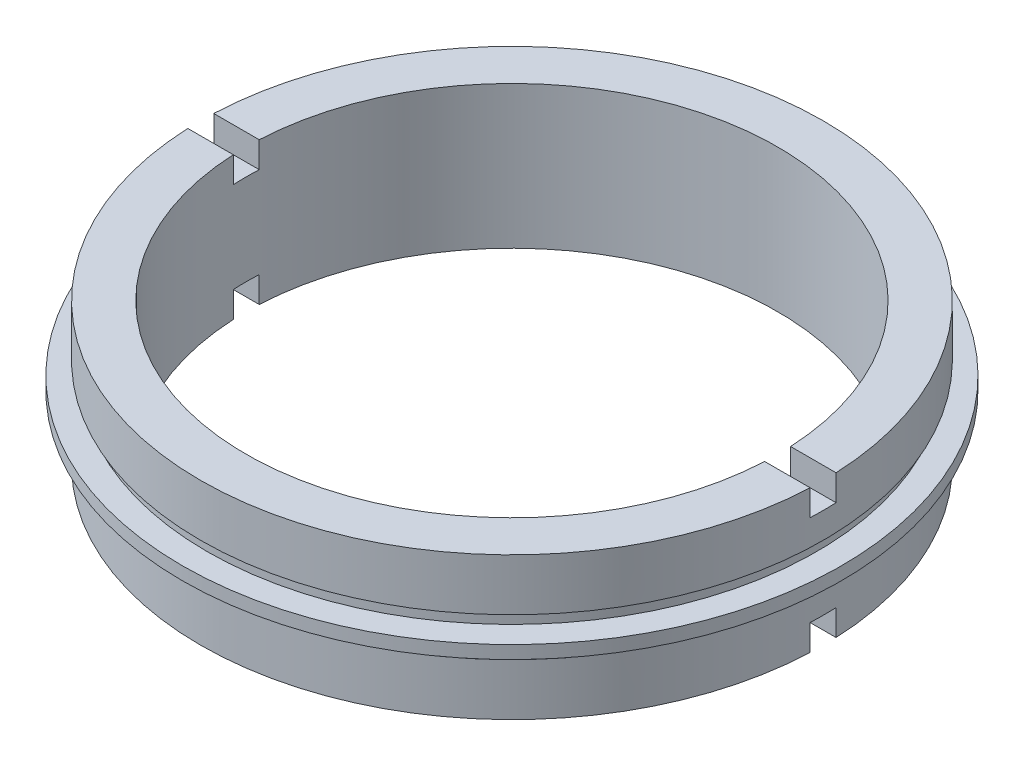
ISO-10303-21;
HEADER;
FILE_DESCRIPTION(('STEP AP214'),'2;1');
FILE_NAME('part.step','',(''),(''),'','','');
FILE_SCHEMA(('AUTOMOTIVE_DESIGN { 1 0 10303 214 1 1 1 1 }'));
ENDSEC;
DATA;
#1=APPLICATION_CONTEXT('core data for automotive mechanical design processes');
#2=APPLICATION_PROTOCOL_DEFINITION('international standard','automotive_design',2000,#1);
#3=PRODUCT_CONTEXT('',#1,'mechanical');
#4=PRODUCT('Part','Part','',(#3));
#5=PRODUCT_RELATED_PRODUCT_CATEGORY('part','',(#4));
#6=PRODUCT_DEFINITION_FORMATION('','',#4);
#7=PRODUCT_DEFINITION_CONTEXT('part definition',#1,'design');
#8=PRODUCT_DEFINITION('design','',#6,#7);
#9=PRODUCT_DEFINITION_SHAPE('','',#8);
#10=(LENGTH_UNIT() NAMED_UNIT(*) SI_UNIT(.MILLI.,.METRE.));
#11=(NAMED_UNIT(*) PLANE_ANGLE_UNIT() SI_UNIT($,.RADIAN.));
#12=(NAMED_UNIT(*) SI_UNIT($,.STERADIAN.) SOLID_ANGLE_UNIT());
#13=UNCERTAINTY_MEASURE_WITH_UNIT(LENGTH_MEASURE(1.E-05),#10,'distance_accuracy_value','');
#14=(GEOMETRIC_REPRESENTATION_CONTEXT(3) GLOBAL_UNCERTAINTY_ASSIGNED_CONTEXT((#13)) GLOBAL_UNIT_ASSIGNED_CONTEXT((#10,
#11,#12)) REPRESENTATION_CONTEXT('',''));
#15=CARTESIAN_POINT('',(0.,0.,0.));
#16=DIRECTION('',(0.,0.,1.));
#17=DIRECTION('',(1.,0.,0.));
#18=AXIS2_PLACEMENT_3D('',#15,#16,#17);
#19=CARTESIAN_POINT('',(-24.,0.,0.));
#20=DIRECTION('',(0.,-1.,0.));
#21=DIRECTION('',(0.,0.,-1.));
#22=AXIS2_PLACEMENT_3D('',#19,#20,#21);
#23=PLANE('',#22);
#24=DIRECTION('',(-1.,0.,0.));
#25=VECTOR('',#24,1.);
#26=CARTESIAN_POINT('',(-24.,0.,1.));
#27=LINE('',#26,#25);
#28=CARTESIAN_POINT('',(23.9791576165636,0.,1.));
#29=VERTEX_POINT('',#28);
#30=CARTESIAN_POINT('',(20.4755952294433,0.,1.));
#31=VERTEX_POINT('',#30);
#32=EDGE_CURVE('E265',#29,#31,#27,.T.);
#33=ORIENTED_EDGE('',*,*,#32,.F.);
#34=CARTESIAN_POINT('',(0.,0.,0.));
#35=DIRECTION('',(0.,1.,0.));
#36=DIRECTION('',(0.,0.,1.));
#37=AXIS2_PLACEMENT_3D('',#34,#35,#36);
#38=CIRCLE('',#37,24.);
#39=CARTESIAN_POINT('',(-23.9791576165636,0.,1.));
#40=VERTEX_POINT('',#39);
#41=EDGE_CURVE('E214',#40,#29,#38,.T.);
#42=ORIENTED_EDGE('',*,*,#41,.F.);
#43=CARTESIAN_POINT('',(-20.4755952294433,0.,1.));
#44=VERTEX_POINT('',#43);
#45=EDGE_CURVE('E264',#44,#40,#27,.T.);
#46=ORIENTED_EDGE('',*,*,#45,.F.);
#47=CARTESIAN_POINT('',(0.,0.,0.));
#48=DIRECTION('',(0.,1.,0.));
#49=DIRECTION('',(0.,0.,1.));
#50=AXIS2_PLACEMENT_3D('',#47,#48,#49);
#51=CIRCLE('',#50,20.5);
#52=EDGE_CURVE('E210',#44,#31,#51,.T.);
#53=ORIENTED_EDGE('',*,*,#52,.T.);
#54=EDGE_LOOP('',(#33,#42,#46,#53));
#55=FACE_BOUND('',#54,.T.);
#56=ADVANCED_FACE('F35',(#55),#23,.T.);
#57=CARTESIAN_POINT('',(-20.5,11.,0.));
#58=DIRECTION('',(0.,1.,0.));
#59=DIRECTION('',(0.,0.,1.));
#60=AXIS2_PLACEMENT_3D('',#57,#58,#59);
#61=PLANE('',#60);
#62=DIRECTION('',(1.,0.,0.));
#63=VECTOR('',#62,1.);
#64=CARTESIAN_POINT('',(-20.5,11.,1.));
#65=LINE('',#64,#63);
#66=CARTESIAN_POINT('',(-23.9791576165636,11.,1.));
#67=VERTEX_POINT('',#66);
#68=CARTESIAN_POINT('',(-20.4755952294433,11.,1.));
#69=VERTEX_POINT('',#68);
#70=EDGE_CURVE('E203',#67,#69,#65,.T.);
#71=ORIENTED_EDGE('',*,*,#70,.F.);
#72=CARTESIAN_POINT('',(0.,11.,0.));
#73=DIRECTION('',(0.,1.,0.));
#74=DIRECTION('',(0.,0.,1.));
#75=AXIS2_PLACEMENT_3D('',#72,#73,#74);
#76=CIRCLE('',#75,24.);
#77=CARTESIAN_POINT('',(23.9791576165636,11.,1.));
#78=VERTEX_POINT('',#77);
#79=EDGE_CURVE('E241',#67,#78,#76,.T.);
#80=ORIENTED_EDGE('',*,*,#79,.T.);
#81=CARTESIAN_POINT('',(20.4755952294433,11.,1.));
#82=VERTEX_POINT('',#81);
#83=EDGE_CURVE('E206',#82,#78,#65,.T.);
#84=ORIENTED_EDGE('',*,*,#83,.F.);
#85=CARTESIAN_POINT('',(0.,11.,0.));
#86=DIRECTION('',(0.,1.,0.));
#87=DIRECTION('',(0.,0.,1.));
#88=AXIS2_PLACEMENT_3D('',#85,#86,#87);
#89=CIRCLE('',#88,20.5);
#90=EDGE_CURVE('E245',#69,#82,#89,.T.);
#91=ORIENTED_EDGE('',*,*,#90,.F.);
#92=EDGE_LOOP('',(#71,#80,#84,#91));
#93=FACE_BOUND('',#92,.T.);
#94=ADVANCED_FACE('F303',(#93),#61,.T.);
#95=CARTESIAN_POINT('',(0.,22.6774994510759,0.));
#96=DIRECTION('',(0.,1.,0.));
#97=DIRECTION('',(0.,0.,1.));
#98=AXIS2_PLACEMENT_3D('',#95,#96,#97);
#99=CYLINDRICAL_SURFACE('',#98,20.5);
#100=DIRECTION('',(0.,1.,0.));
#101=VECTOR('',#100,1.);
#102=CARTESIAN_POINT('',(-20.4755952294433,22.6774994510759,1.));
#103=LINE('',#102,#101);
#104=CARTESIAN_POINT('',(-20.4755952294433,2.,1.));
#105=VERTEX_POINT('',#104);
#106=EDGE_CURVE('E177',#105,#44,#103,.F.);
#107=ORIENTED_EDGE('',*,*,#106,.F.);
#108=CARTESIAN_POINT('',(0.,2.,0.));
#109=DIRECTION('',(0.,1.,0.));
#110=DIRECTION('',(0.,0.,1.));
#111=AXIS2_PLACEMENT_3D('',#108,#109,#110);
#112=CIRCLE('',#111,20.5);
#113=CARTESIAN_POINT('',(-20.4755952294433,2.,-1.));
#114=VERTEX_POINT('',#113);
#115=EDGE_CURVE('E183',#114,#105,#112,.T.);
#116=ORIENTED_EDGE('',*,*,#115,.F.);
#117=DIRECTION('',(0.,1.,0.));
#118=VECTOR('',#117,1.);
#119=CARTESIAN_POINT('',(-20.4755952294433,22.6774994510759,-0.999999999999994));
#120=LINE('',#119,#118);
#121=CARTESIAN_POINT('',(-20.4755952294433,0.,-1.));
#122=VERTEX_POINT('',#121);
#123=EDGE_CURVE('E159',#122,#114,#120,.T.);
#124=ORIENTED_EDGE('',*,*,#123,.F.);
#125=CARTESIAN_POINT('',(20.4755952294433,0.,-1.));
#126=VERTEX_POINT('',#125);
#127=EDGE_CURVE('E213',#126,#122,#51,.T.);
#128=ORIENTED_EDGE('',*,*,#127,.F.);
#129=DIRECTION('',(0.,1.,0.));
#130=VECTOR('',#129,1.);
#131=CARTESIAN_POINT('',(20.4755952294433,22.6774994510759,-0.999999999999994));
#132=LINE('',#131,#130);
#133=CARTESIAN_POINT('',(20.4755952294433,2.,-1.));
#134=VERTEX_POINT('',#133);
#135=EDGE_CURVE('E58',#134,#126,#132,.F.);
#136=ORIENTED_EDGE('',*,*,#135,.F.);
#137=CARTESIAN_POINT('',(20.4755952294433,2.,1.));
#138=VERTEX_POINT('',#137);
#139=EDGE_CURVE('E185',#138,#134,#112,.T.);
#140=ORIENTED_EDGE('',*,*,#139,.F.);
#141=DIRECTION('',(0.,1.,0.));
#142=VECTOR('',#141,1.);
#143=CARTESIAN_POINT('',(20.4755952294433,22.6774994510759,1.));
#144=LINE('',#143,#142);
#145=EDGE_CURVE('E181',#31,#138,#144,.T.);
#146=ORIENTED_EDGE('',*,*,#145,.F.);
#147=ORIENTED_EDGE('',*,*,#52,.F.);
#148=EDGE_LOOP('',(#107,#116,#124,#128,#136,#140,#146,#147));
#149=FACE_BOUND('',#148,.T.);
#150=DIRECTION('',(0.,1.,0.));
#151=VECTOR('',#150,1.);
#152=CARTESIAN_POINT('',(20.4755952294433,22.6774994510759,1.));
#153=LINE('',#152,#151);
#154=CARTESIAN_POINT('',(20.4755952294433,9.,1.));
#155=VERTEX_POINT('',#154);
#156=EDGE_CURVE('E208',#155,#82,#153,.T.);
#157=ORIENTED_EDGE('',*,*,#156,.F.);
#158=CARTESIAN_POINT('',(0.,9.,0.));
#159=DIRECTION('',(0.,-1.,0.));
#160=DIRECTION('',(0.,0.,-1.));
#161=AXIS2_PLACEMENT_3D('',#158,#159,#160);
#162=CIRCLE('',#161,20.5);
#163=CARTESIAN_POINT('',(20.4755952294433,9.,-0.999999999999997));
#164=VERTEX_POINT('',#163);
#165=EDGE_CURVE('E195',#164,#155,#162,.T.);
#166=ORIENTED_EDGE('',*,*,#165,.F.);
#167=DIRECTION('',(0.,1.,0.));
#168=VECTOR('',#167,1.);
#169=CARTESIAN_POINT('',(20.4755952294433,22.6774994510759,-1.));
#170=LINE('',#169,#168);
#171=CARTESIAN_POINT('',(20.4755952294433,11.,-0.999999999999998));
#172=VERTEX_POINT('',#171);
#173=EDGE_CURVE('E198',#172,#164,#170,.F.);
#174=ORIENTED_EDGE('',*,*,#173,.F.);
#175=CARTESIAN_POINT('',(-20.4755952294433,11.,-0.999999999999998));
#176=VERTEX_POINT('',#175);
#177=EDGE_CURVE('E248',#172,#176,#89,.T.);
#178=ORIENTED_EDGE('',*,*,#177,.T.);
#179=DIRECTION('',(0.,1.,0.));
#180=VECTOR('',#179,1.);
#181=CARTESIAN_POINT('',(-20.4755952294433,22.6774994510759,-1.));
#182=LINE('',#181,#180);
#183=CARTESIAN_POINT('',(-20.4755952294433,9.,-0.999999999999997));
#184=VERTEX_POINT('',#183);
#185=EDGE_CURVE('E201',#184,#176,#182,.T.);
#186=ORIENTED_EDGE('',*,*,#185,.F.);
#187=CARTESIAN_POINT('',(-20.4755952294433,9.,1.));
#188=VERTEX_POINT('',#187);
#189=EDGE_CURVE('E193',#188,#184,#162,.T.);
#190=ORIENTED_EDGE('',*,*,#189,.F.);
#191=DIRECTION('',(0.,1.,0.));
#192=VECTOR('',#191,1.);
#193=CARTESIAN_POINT('',(-20.4755952294433,22.6774994510759,1.));
#194=LINE('',#193,#192);
#195=EDGE_CURVE('E205',#69,#188,#194,.F.);
#196=ORIENTED_EDGE('',*,*,#195,.F.);
#197=ORIENTED_EDGE('',*,*,#90,.T.);
#198=EDGE_LOOP('',(#157,#166,#174,#178,#186,#190,#196,#197));
#199=FACE_BOUND('',#198,.T.);
#200=ADVANCED_FACE('F37',(#149,#199),#99,.F.);
#201=DIRECTION('',(-1.,0.,0.));
#202=VECTOR('',#201,1.);
#203=CARTESIAN_POINT('',(-20.5,11.,-0.999999999999998));
#204=LINE('',#203,#202);
#205=CARTESIAN_POINT('',(23.9791576165636,11.,-1.));
#206=VERTEX_POINT('',#205);
#207=EDGE_CURVE('E196',#206,#172,#204,.T.);
#208=ORIENTED_EDGE('',*,*,#207,.F.);
#209=CARTESIAN_POINT('',(-23.9791576165636,11.,-1.));
#210=VERTEX_POINT('',#209);
#211=EDGE_CURVE('E244',#206,#210,#76,.T.);
#212=ORIENTED_EDGE('',*,*,#211,.T.);
#213=EDGE_CURVE('E199',#176,#210,#204,.T.);
#214=ORIENTED_EDGE('',*,*,#213,.F.);
#215=ORIENTED_EDGE('',*,*,#177,.F.);
#216=EDGE_LOOP('',(#208,#212,#214,#215));
#217=FACE_BOUND('',#216,.T.);
#218=ADVANCED_FACE('F309',(#217),#61,.T.);
#219=CARTESIAN_POINT('',(0.,22.6774994510759,0.));
#220=DIRECTION('',(0.,1.,0.));
#221=DIRECTION('',(0.,0.,1.));
#222=AXIS2_PLACEMENT_3D('',#219,#220,#221);
#223=CYLINDRICAL_SURFACE('',#222,24.);
#224=DIRECTION('',(0.,1.,0.));
#225=VECTOR('',#224,1.);
#226=CARTESIAN_POINT('',(-23.9791576165636,22.6774994510759,1.));
#227=LINE('',#226,#225);
#228=CARTESIAN_POINT('',(-23.9791576165636,9.,1.));
#229=VERTEX_POINT('',#228);
#230=EDGE_CURVE('E260',#229,#67,#227,.T.);
#231=ORIENTED_EDGE('',*,*,#230,.F.);
#232=CARTESIAN_POINT('',(0.,9.,0.));
#233=DIRECTION('',(0.,-1.,0.));
#234=DIRECTION('',(0.,0.,-1.));
#235=AXIS2_PLACEMENT_3D('',#232,#233,#234);
#236=CIRCLE('',#235,24.);
#237=CARTESIAN_POINT('',(-23.9791576165636,9.,-0.999999999999997));
#238=VERTEX_POINT('',#237);
#239=EDGE_CURVE('E252',#238,#229,#236,.F.);
#240=ORIENTED_EDGE('',*,*,#239,.F.);
#241=DIRECTION('',(0.,1.,0.));
#242=VECTOR('',#241,1.);
#243=CARTESIAN_POINT('',(-23.9791576165636,22.6774994510759,-1.));
#244=LINE('',#243,#242);
#245=EDGE_CURVE('E257',#210,#238,#244,.F.);
#246=ORIENTED_EDGE('',*,*,#245,.F.);
#247=ORIENTED_EDGE('',*,*,#211,.F.);
#248=DIRECTION('',(0.,1.,0.));
#249=VECTOR('',#248,1.);
#250=CARTESIAN_POINT('',(23.9791576165636,22.6774994510759,-1.));
#251=LINE('',#250,#249);
#252=CARTESIAN_POINT('',(23.9791576165636,9.,-0.999999999999997));
#253=VERTEX_POINT('',#252);
#254=EDGE_CURVE('E251',#253,#206,#251,.T.);
#255=ORIENTED_EDGE('',*,*,#254,.F.);
#256=CARTESIAN_POINT('',(23.9791576165636,9.,1.));
#257=VERTEX_POINT('',#256);
#258=EDGE_CURVE('E249',#257,#253,#236,.F.);
#259=ORIENTED_EDGE('',*,*,#258,.F.);
#260=DIRECTION('',(0.,1.,0.));
#261=VECTOR('',#260,1.);
#262=CARTESIAN_POINT('',(23.9791576165636,22.6774994510759,1.));
#263=LINE('',#262,#261);
#264=EDGE_CURVE('E254',#78,#257,#263,.F.);
#265=ORIENTED_EDGE('',*,*,#264,.F.);
#266=ORIENTED_EDGE('',*,*,#79,.F.);
#267=EDGE_LOOP('',(#231,#240,#246,#247,#255,#259,#265,#266));
#268=FACE_BOUND('',#267,.T.);
#269=CARTESIAN_POINT('',(0.,7.,0.));
#270=DIRECTION('',(0.,1.,0.));
#271=DIRECTION('',(0.,0.,1.));
#272=AXIS2_PLACEMENT_3D('',#269,#270,#271);
#273=CIRCLE('',#272,24.);
#274=CARTESIAN_POINT('',(0.,7.,24.));
#275=VERTEX_POINT('',#274);
#276=EDGE_CURVE('E238',#275,#275,#273,.T.);
#277=ORIENTED_EDGE('',*,*,#276,.T.);
#278=EDGE_LOOP('',(#277));
#279=FACE_BOUND('',#278,.T.);
#280=ADVANCED_FACE('F352',(#268,#279),#223,.T.);
#281=CARTESIAN_POINT('',(-24.,7.,0.));
#282=DIRECTION('',(0.,-1.,0.));
#283=DIRECTION('',(0.,0.,-1.));
#284=AXIS2_PLACEMENT_3D('',#281,#282,#283);
#285=PLANE('',#284);
#286=CARTESIAN_POINT('',(0.,7.,0.));
#287=DIRECTION('',(0.,1.,0.));
#288=DIRECTION('',(0.,0.,1.));
#289=AXIS2_PLACEMENT_3D('',#286,#287,#288);
#290=CIRCLE('',#289,23.5);
#291=CARTESIAN_POINT('',(0.,7.,23.5));
#292=VERTEX_POINT('',#291);
#293=EDGE_CURVE('E235',#292,#292,#290,.T.);
#294=ORIENTED_EDGE('',*,*,#293,.T.);
#295=EDGE_LOOP('',(#294));
#296=FACE_BOUND('',#295,.T.);
#297=ORIENTED_EDGE('',*,*,#276,.F.);
#298=EDGE_LOOP('',(#297));
#299=FACE_BOUND('',#298,.T.);
#300=ADVANCED_FACE('F348',(#296,#299),#285,.T.);
#301=CARTESIAN_POINT('',(0.,22.6774994510759,0.));
#302=DIRECTION('',(0.,1.,0.));
#303=DIRECTION('',(0.,0.,1.));
#304=AXIS2_PLACEMENT_3D('',#301,#302,#303);
#305=CYLINDRICAL_SURFACE('',#304,23.5);
#306=CARTESIAN_POINT('',(0.,6.,0.));
#307=DIRECTION('',(0.,1.,0.));
#308=DIRECTION('',(0.,0.,1.));
#309=AXIS2_PLACEMENT_3D('',#306,#307,#308);
#310=CIRCLE('',#309,23.5);
#311=CARTESIAN_POINT('',(0.,6.,23.5));
#312=VERTEX_POINT('',#311);
#313=EDGE_CURVE('E232',#312,#312,#310,.T.);
#314=ORIENTED_EDGE('',*,*,#313,.T.);
#315=EDGE_LOOP('',(#314));
#316=FACE_BOUND('',#315,.T.);
#317=ORIENTED_EDGE('',*,*,#293,.F.);
#318=EDGE_LOOP('',(#317));
#319=FACE_BOUND('',#318,.T.);
#320=ADVANCED_FACE('F344',(#316,#319),#305,.T.);
#321=CARTESIAN_POINT('',(-23.5,6.,0.));
#322=DIRECTION('',(0.,1.,0.));
#323=DIRECTION('',(0.,0.,1.));
#324=AXIS2_PLACEMENT_3D('',#321,#322,#323);
#325=PLANE('',#324);
#326=CARTESIAN_POINT('',(0.,6.,0.));
#327=DIRECTION('',(0.,1.,0.));
#328=DIRECTION('',(0.,0.,1.));
#329=AXIS2_PLACEMENT_3D('',#326,#327,#328);
#330=CIRCLE('',#329,25.4);
#331=CARTESIAN_POINT('',(0.,6.,25.4));
#332=VERTEX_POINT('',#331);
#333=EDGE_CURVE('E229',#332,#332,#330,.T.);
#334=ORIENTED_EDGE('',*,*,#333,.T.);
#335=EDGE_LOOP('',(#334));
#336=FACE_BOUND('',#335,.T.);
#337=ORIENTED_EDGE('',*,*,#313,.F.);
#338=EDGE_LOOP('',(#337));
#339=FACE_BOUND('',#338,.T.);
#340=ADVANCED_FACE('F340',(#336,#339),#325,.T.);
#341=CARTESIAN_POINT('',(0.,22.6774994510759,0.));
#342=DIRECTION('',(0.,1.,0.));
#343=DIRECTION('',(0.,0.,1.));
#344=AXIS2_PLACEMENT_3D('',#341,#342,#343);
#345=CYLINDRICAL_SURFACE('',#344,25.4);
#346=CARTESIAN_POINT('',(0.,5.,0.));
#347=DIRECTION('',(0.,1.,0.));
#348=DIRECTION('',(0.,0.,1.));
#349=AXIS2_PLACEMENT_3D('',#346,#347,#348);
#350=CIRCLE('',#349,25.4);
#351=CARTESIAN_POINT('',(0.,5.,25.4));
#352=VERTEX_POINT('',#351);
#353=EDGE_CURVE('E226',#352,#352,#350,.T.);
#354=ORIENTED_EDGE('',*,*,#353,.T.);
#355=EDGE_LOOP('',(#354));
#356=FACE_BOUND('',#355,.T.);
#357=ORIENTED_EDGE('',*,*,#333,.F.);
#358=EDGE_LOOP('',(#357));
#359=FACE_BOUND('',#358,.T.);
#360=ADVANCED_FACE('F336',(#356,#359),#345,.T.);
#361=CARTESIAN_POINT('',(-25.4,5.,0.));
#362=DIRECTION('',(0.,-1.,0.));
#363=DIRECTION('',(0.,0.,-1.));
#364=AXIS2_PLACEMENT_3D('',#361,#362,#363);
#365=PLANE('',#364);
#366=CARTESIAN_POINT('',(0.,5.,0.));
#367=DIRECTION('',(0.,1.,0.));
#368=DIRECTION('',(0.,0.,1.));
#369=AXIS2_PLACEMENT_3D('',#366,#367,#368);
#370=CIRCLE('',#369,23.5);
#371=CARTESIAN_POINT('',(0.,5.,23.5));
#372=VERTEX_POINT('',#371);
#373=EDGE_CURVE('E223',#372,#372,#370,.T.);
#374=ORIENTED_EDGE('',*,*,#373,.T.);
#375=EDGE_LOOP('',(#374));
#376=FACE_BOUND('',#375,.T.);
#377=ORIENTED_EDGE('',*,*,#353,.F.);
#378=EDGE_LOOP('',(#377));
#379=FACE_BOUND('',#378,.T.);
#380=ADVANCED_FACE('F332',(#376,#379),#365,.T.);
#381=CARTESIAN_POINT('',(0.,22.6774994510759,0.));
#382=DIRECTION('',(0.,1.,0.));
#383=DIRECTION('',(0.,0.,1.));
#384=AXIS2_PLACEMENT_3D('',#381,#382,#383);
#385=CYLINDRICAL_SURFACE('',#384,23.5);
#386=CARTESIAN_POINT('',(0.,4.,0.));
#387=DIRECTION('',(0.,1.,0.));
#388=DIRECTION('',(0.,0.,1.));
#389=AXIS2_PLACEMENT_3D('',#386,#387,#388);
#390=CIRCLE('',#389,23.5);
#391=CARTESIAN_POINT('',(0.,4.,23.5));
#392=VERTEX_POINT('',#391);
#393=EDGE_CURVE('E220',#392,#392,#390,.T.);
#394=ORIENTED_EDGE('',*,*,#393,.T.);
#395=EDGE_LOOP('',(#394));
#396=FACE_BOUND('',#395,.T.);
#397=ORIENTED_EDGE('',*,*,#373,.F.);
#398=EDGE_LOOP('',(#397));
#399=FACE_BOUND('',#398,.T.);
#400=ADVANCED_FACE('F326',(#396,#399),#385,.T.);
#401=CARTESIAN_POINT('',(-23.5,4.,0.));
#402=DIRECTION('',(0.,1.,0.));
#403=DIRECTION('',(0.,0.,1.));
#404=AXIS2_PLACEMENT_3D('',#401,#402,#403);
#405=PLANE('',#404);
#406=CARTESIAN_POINT('',(0.,4.,0.));
#407=DIRECTION('',(0.,1.,0.));
#408=DIRECTION('',(0.,0.,1.));
#409=AXIS2_PLACEMENT_3D('',#406,#407,#408);
#410=CIRCLE('',#409,24.);
#411=CARTESIAN_POINT('',(0.,4.,24.));
#412=VERTEX_POINT('',#411);
#413=EDGE_CURVE('E217',#412,#412,#410,.T.);
#414=ORIENTED_EDGE('',*,*,#413,.T.);
#415=EDGE_LOOP('',(#414));
#416=FACE_BOUND('',#415,.T.);
#417=ORIENTED_EDGE('',*,*,#393,.F.);
#418=EDGE_LOOP('',(#417));
#419=FACE_BOUND('',#418,.T.);
#420=ADVANCED_FACE('F322',(#416,#419),#405,.T.);
#421=CARTESIAN_POINT('',(0.,22.6774994510759,0.));
#422=DIRECTION('',(0.,1.,0.));
#423=DIRECTION('',(0.,0.,1.));
#424=AXIS2_PLACEMENT_3D('',#421,#422,#423);
#425=CYLINDRICAL_SURFACE('',#424,24.);
#426=DIRECTION('',(0.,1.,0.));
#427=VECTOR('',#426,1.);
#428=CARTESIAN_POINT('',(-23.9791576165636,22.6774994510759,1.));
#429=LINE('',#428,#427);
#430=CARTESIAN_POINT('',(-23.9791576165636,2.,1.));
#431=VERTEX_POINT('',#430);
#432=EDGE_CURVE('E170',#40,#431,#429,.T.);
#433=ORIENTED_EDGE('',*,*,#432,.F.);
#434=ORIENTED_EDGE('',*,*,#41,.T.);
#435=DIRECTION('',(0.,1.,0.));
#436=VECTOR('',#435,1.);
#437=CARTESIAN_POINT('',(23.9791576165636,22.6774994510759,1.));
#438=LINE('',#437,#436);
#439=CARTESIAN_POINT('',(23.9791576165636,2.,1.));
#440=VERTEX_POINT('',#439);
#441=EDGE_CURVE('E179',#440,#29,#438,.F.);
#442=ORIENTED_EDGE('',*,*,#441,.F.);
#443=CARTESIAN_POINT('',(0.,2.,0.));
#444=DIRECTION('',(0.,1.,0.));
#445=DIRECTION('',(0.,0.,1.));
#446=AXIS2_PLACEMENT_3D('',#443,#444,#445);
#447=CIRCLE('',#446,24.);
#448=CARTESIAN_POINT('',(23.9791576165636,2.,-1.));
#449=VERTEX_POINT('',#448);
#450=EDGE_CURVE('E39',#449,#440,#447,.F.);
#451=ORIENTED_EDGE('',*,*,#450,.F.);
#452=DIRECTION('',(0.,1.,0.));
#453=VECTOR('',#452,1.);
#454=CARTESIAN_POINT('',(23.9791576165636,22.6774994510759,-0.999999999999994));
#455=LINE('',#454,#453);
#456=CARTESIAN_POINT('',(23.9791576165636,0.,-1.));
#457=VERTEX_POINT('',#456);
#458=EDGE_CURVE('E172',#457,#449,#455,.T.);
#459=ORIENTED_EDGE('',*,*,#458,.F.);
#460=CARTESIAN_POINT('',(-23.9791576165636,0.,-1.));
#461=VERTEX_POINT('',#460);
#462=EDGE_CURVE('E168',#457,#461,#38,.T.);
#463=ORIENTED_EDGE('',*,*,#462,.T.);
#464=DIRECTION('',(0.,1.,0.));
#465=VECTOR('',#464,1.);
#466=CARTESIAN_POINT('',(-23.9791576165636,22.6774994510759,-0.999999999999994));
#467=LINE('',#466,#465);
#468=CARTESIAN_POINT('',(-23.9791576165636,2.,-1.));
#469=VERTEX_POINT('',#468);
#470=EDGE_CURVE('E50',#469,#461,#467,.F.);
#471=ORIENTED_EDGE('',*,*,#470,.F.);
#472=EDGE_CURVE('E11',#431,#469,#447,.F.);
#473=ORIENTED_EDGE('',*,*,#472,.F.);
#474=EDGE_LOOP('',(#433,#434,#442,#451,#459,#463,#471,#473));
#475=FACE_BOUND('',#474,.T.);
#476=ORIENTED_EDGE('',*,*,#413,.F.);
#477=EDGE_LOOP('',(#476));
#478=FACE_BOUND('',#477,.T.);
#479=ADVANCED_FACE('F164',(#475,#478),#425,.T.);
#480=DIRECTION('',(1.,0.,0.));
#481=VECTOR('',#480,1.);
#482=CARTESIAN_POINT('',(-24.,0.,-1.));
#483=LINE('',#482,#481);
#484=EDGE_CURVE('E263',#461,#122,#483,.T.);
#485=ORIENTED_EDGE('',*,*,#484,.F.);
#486=ORIENTED_EDGE('',*,*,#462,.F.);
#487=EDGE_CURVE('E262',#126,#457,#483,.T.);
#488=ORIENTED_EDGE('',*,*,#487,.F.);
#489=ORIENTED_EDGE('',*,*,#127,.T.);
#490=EDGE_LOOP('',(#485,#486,#488,#489));
#491=FACE_BOUND('',#490,.T.);
#492=ADVANCED_FACE('F274',(#491),#23,.T.);
#493=CARTESIAN_POINT('',(-39.5,9.,1.));
#494=DIRECTION('',(0.,-1.,0.));
#495=DIRECTION('',(0.,0.,-1.));
#496=AXIS2_PLACEMENT_3D('',#493,#494,#495);
#497=PLANE('',#496);
#498=ORIENTED_EDGE('',*,*,#165,.T.);
#499=DIRECTION('',(1.,0.,0.));
#500=VECTOR('',#499,1.);
#501=CARTESIAN_POINT('',(-39.5,9.,1.));
#502=LINE('',#501,#500);
#503=EDGE_CURVE('E191',#155,#257,#502,.T.);
#504=ORIENTED_EDGE('',*,*,#503,.T.);
#505=ORIENTED_EDGE('',*,*,#258,.T.);
#506=DIRECTION('',(1.,0.,0.));
#507=VECTOR('',#506,1.);
#508=CARTESIAN_POINT('',(-39.5,9.,-0.999999999999997));
#509=LINE('',#508,#507);
#510=EDGE_CURVE('E186',#164,#253,#509,.T.);
#511=ORIENTED_EDGE('',*,*,#510,.F.);
#512=EDGE_LOOP('',(#498,#504,#505,#511));
#513=FACE_BOUND('',#512,.T.);
#514=ADVANCED_FACE('F313',(#513),#497,.F.);
#515=CARTESIAN_POINT('',(-39.5,13.5939878717808,-0.999999999999998));
#516=DIRECTION('',(0.,0.,-1.));
#517=DIRECTION('',(0.,1.,0.));
#518=AXIS2_PLACEMENT_3D('',#515,#516,#517);
#519=PLANE('',#518);
#520=ORIENTED_EDGE('',*,*,#173,.T.);
#521=ORIENTED_EDGE('',*,*,#510,.T.);
#522=ORIENTED_EDGE('',*,*,#254,.T.);
#523=ORIENTED_EDGE('',*,*,#207,.T.);
#524=EDGE_LOOP('',(#520,#521,#522,#523));
#525=FACE_BOUND('',#524,.T.);
#526=ADVANCED_FACE('F318',(#525),#519,.F.);
#527=CARTESIAN_POINT('',(-39.5,13.5939878717808,1.));
#528=DIRECTION('',(0.,0.,1.));
#529=DIRECTION('',(0.,-1.,0.));
#530=AXIS2_PLACEMENT_3D('',#527,#528,#529);
#531=PLANE('',#530);
#532=ORIENTED_EDGE('',*,*,#156,.T.);
#533=ORIENTED_EDGE('',*,*,#83,.T.);
#534=ORIENTED_EDGE('',*,*,#264,.T.);
#535=ORIENTED_EDGE('',*,*,#503,.F.);
#536=EDGE_LOOP('',(#532,#533,#534,#535));
#537=FACE_BOUND('',#536,.T.);
#538=ADVANCED_FACE('F401',(#537),#531,.F.);
#539=ORIENTED_EDGE('',*,*,#185,.T.);
#540=ORIENTED_EDGE('',*,*,#213,.T.);
#541=ORIENTED_EDGE('',*,*,#245,.T.);
#542=EDGE_CURVE('E189',#238,#184,#509,.T.);
#543=ORIENTED_EDGE('',*,*,#542,.T.);
#544=EDGE_LOOP('',(#539,#540,#541,#543));
#545=FACE_BOUND('',#544,.T.);
#546=ADVANCED_FACE('F377',(#545),#519,.F.);
#547=ORIENTED_EDGE('',*,*,#195,.T.);
#548=EDGE_CURVE('E190',#229,#188,#502,.T.);
#549=ORIENTED_EDGE('',*,*,#548,.F.);
#550=ORIENTED_EDGE('',*,*,#230,.T.);
#551=ORIENTED_EDGE('',*,*,#70,.T.);
#552=EDGE_LOOP('',(#547,#549,#550,#551));
#553=FACE_BOUND('',#552,.T.);
#554=ADVANCED_FACE('F392',(#553),#531,.F.);
#555=ORIENTED_EDGE('',*,*,#189,.T.);
#556=ORIENTED_EDGE('',*,*,#542,.F.);
#557=ORIENTED_EDGE('',*,*,#239,.T.);
#558=ORIENTED_EDGE('',*,*,#548,.T.);
#559=EDGE_LOOP('',(#555,#556,#557,#558));
#560=FACE_BOUND('',#559,.T.);
#561=ADVANCED_FACE('F321',(#560),#497,.F.);
#562=CARTESIAN_POINT('',(-39.5,2.,-1.));
#563=DIRECTION('',(0.,0.,-1.));
#564=DIRECTION('',(0.,1.,0.));
#565=AXIS2_PLACEMENT_3D('',#562,#563,#564);
#566=PLANE('',#565);
#567=ORIENTED_EDGE('',*,*,#135,.T.);
#568=ORIENTED_EDGE('',*,*,#487,.T.);
#569=ORIENTED_EDGE('',*,*,#458,.T.);
#570=DIRECTION('',(1.,0.,0.));
#571=VECTOR('',#570,1.);
#572=CARTESIAN_POINT('',(-39.5,2.,-1.));
#573=LINE('',#572,#571);
#574=EDGE_CURVE('E161',#134,#449,#573,.T.);
#575=ORIENTED_EDGE('',*,*,#574,.F.);
#576=EDGE_LOOP('',(#567,#568,#569,#575));
#577=FACE_BOUND('',#576,.T.);
#578=ADVANCED_FACE('F275',(#577),#566,.F.);
#579=CARTESIAN_POINT('',(-39.5,2.,1.));
#580=DIRECTION('',(0.,0.,1.));
#581=DIRECTION('',(0.,-1.,0.));
#582=AXIS2_PLACEMENT_3D('',#579,#580,#581);
#583=PLANE('',#582);
#584=ORIENTED_EDGE('',*,*,#145,.T.);
#585=DIRECTION('',(1.,0.,0.));
#586=VECTOR('',#585,1.);
#587=CARTESIAN_POINT('',(-39.5,2.,1.));
#588=LINE('',#587,#586);
#589=EDGE_CURVE('E160',#138,#440,#588,.T.);
#590=ORIENTED_EDGE('',*,*,#589,.T.);
#591=ORIENTED_EDGE('',*,*,#441,.T.);
#592=ORIENTED_EDGE('',*,*,#32,.T.);
#593=EDGE_LOOP('',(#584,#590,#591,#592));
#594=FACE_BOUND('',#593,.T.);
#595=ADVANCED_FACE('F283',(#594),#583,.F.);
#596=CARTESIAN_POINT('',(-39.5,2.,1.));
#597=DIRECTION('',(0.,1.,0.));
#598=DIRECTION('',(0.,0.,1.));
#599=AXIS2_PLACEMENT_3D('',#596,#597,#598);
#600=PLANE('',#599);
#601=ORIENTED_EDGE('',*,*,#139,.T.);
#602=ORIENTED_EDGE('',*,*,#574,.T.);
#603=ORIENTED_EDGE('',*,*,#450,.T.);
#604=ORIENTED_EDGE('',*,*,#589,.F.);
#605=EDGE_LOOP('',(#601,#602,#603,#604));
#606=FACE_BOUND('',#605,.T.);
#607=ADVANCED_FACE('F291',(#606),#600,.F.);
#608=ORIENTED_EDGE('',*,*,#123,.T.);
#609=EDGE_CURVE('E151',#469,#114,#573,.T.);
#610=ORIENTED_EDGE('',*,*,#609,.F.);
#611=ORIENTED_EDGE('',*,*,#470,.T.);
#612=ORIENTED_EDGE('',*,*,#484,.T.);
#613=EDGE_LOOP('',(#608,#610,#611,#612));
#614=FACE_BOUND('',#613,.T.);
#615=ADVANCED_FACE('F157',(#614),#566,.F.);
#616=ORIENTED_EDGE('',*,*,#106,.T.);
#617=ORIENTED_EDGE('',*,*,#45,.T.);
#618=ORIENTED_EDGE('',*,*,#432,.T.);
#619=EDGE_CURVE('E154',#431,#105,#588,.T.);
#620=ORIENTED_EDGE('',*,*,#619,.T.);
#621=EDGE_LOOP('',(#616,#617,#618,#620));
#622=FACE_BOUND('',#621,.T.);
#623=ADVANCED_FACE('F298',(#622),#583,.F.);
#624=ORIENTED_EDGE('',*,*,#115,.T.);
#625=ORIENTED_EDGE('',*,*,#619,.F.);
#626=ORIENTED_EDGE('',*,*,#472,.T.);
#627=ORIENTED_EDGE('',*,*,#609,.T.);
#628=EDGE_LOOP('',(#624,#625,#626,#627));
#629=FACE_BOUND('',#628,.T.);
#630=ADVANCED_FACE('F150',(#629),#600,.F.);
#631=CLOSED_SHELL('',(#56,#94,#200,#218,#280,#300,#320,#340,#360,#380,#400,#420,#479,#492,#514,
#526,#538,#546,#554,#561,#578,#595,#607,#615,#623,#630));
#632=MANIFOLD_SOLID_BREP('B2',#631);
#633=ADVANCED_BREP_SHAPE_REPRESENTATION('',(#18,#632),#14);
#634=SHAPE_DEFINITION_REPRESENTATION(#9,#633);
ENDSEC;
END-ISO-10303-21;
